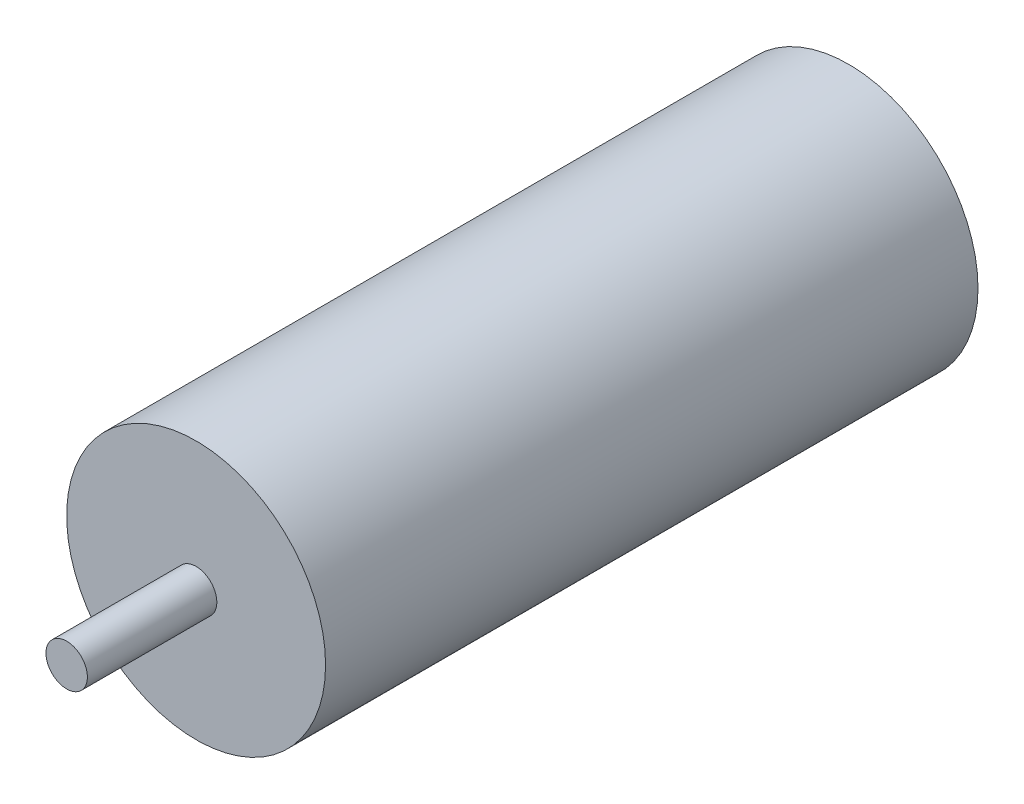
ISO-10303-21;
HEADER;
FILE_DESCRIPTION(('STEP AP214'),'2;1');
FILE_NAME('part.step','',(''),(''),'','','');
FILE_SCHEMA(('AUTOMOTIVE_DESIGN { 1 0 10303 214 1 1 1 1 }'));
ENDSEC;
DATA;
#1=APPLICATION_CONTEXT('core data for automotive mechanical design processes');
#2=APPLICATION_PROTOCOL_DEFINITION('international standard','automotive_design',2000,#1);
#3=PRODUCT_CONTEXT('',#1,'mechanical');
#4=PRODUCT('Part','Part','',(#3));
#5=PRODUCT_RELATED_PRODUCT_CATEGORY('part','',(#4));
#6=PRODUCT_DEFINITION_FORMATION('','',#4);
#7=PRODUCT_DEFINITION_CONTEXT('part definition',#1,'design');
#8=PRODUCT_DEFINITION('design','',#6,#7);
#9=PRODUCT_DEFINITION_SHAPE('','',#8);
#10=(LENGTH_UNIT() NAMED_UNIT(*) SI_UNIT(.MILLI.,.METRE.));
#11=(NAMED_UNIT(*) PLANE_ANGLE_UNIT() SI_UNIT($,.RADIAN.));
#12=(NAMED_UNIT(*) SI_UNIT($,.STERADIAN.) SOLID_ANGLE_UNIT());
#13=UNCERTAINTY_MEASURE_WITH_UNIT(LENGTH_MEASURE(1.E-05),#10,'distance_accuracy_value','');
#14=(GEOMETRIC_REPRESENTATION_CONTEXT(3) GLOBAL_UNCERTAINTY_ASSIGNED_CONTEXT((#13)) GLOBAL_UNIT_ASSIGNED_CONTEXT((#10,
#11,#12)) REPRESENTATION_CONTEXT('',''));
#15=CARTESIAN_POINT('',(0.,0.,0.));
#16=DIRECTION('',(0.,0.,1.));
#17=DIRECTION('',(1.,0.,0.));
#18=AXIS2_PLACEMENT_3D('',#15,#16,#17);
#19=CARTESIAN_POINT('',(0.,0.,63.));
#20=DIRECTION('',(0.,0.,-1.));
#21=DIRECTION('',(-1.,0.,0.));
#22=AXIS2_PLACEMENT_3D('',#19,#20,#21);
#23=CYLINDRICAL_SURFACE('',#22,12.5);
#24=CARTESIAN_POINT('',(0.,0.,63.));
#25=DIRECTION('',(0.,0.,1.));
#26=DIRECTION('',(1.,0.,0.));
#27=AXIS2_PLACEMENT_3D('',#24,#25,#26);
#28=CIRCLE('',#27,12.5);
#29=CARTESIAN_POINT('',(12.5,0.,63.));
#30=VERTEX_POINT('',#29);
#31=EDGE_CURVE('E38',#30,#30,#28,.T.);
#32=ORIENTED_EDGE('',*,*,#31,.F.);
#33=EDGE_LOOP('',(#32));
#34=FACE_BOUND('',#33,.T.);
#35=CARTESIAN_POINT('',(0.,0.,0.));
#36=DIRECTION('',(0.,0.,1.));
#37=DIRECTION('',(1.,0.,0.));
#38=AXIS2_PLACEMENT_3D('',#35,#36,#37);
#39=CIRCLE('',#38,12.5);
#40=CARTESIAN_POINT('',(12.5,0.,0.));
#41=VERTEX_POINT('',#40);
#42=EDGE_CURVE('E34',#41,#41,#39,.T.);
#43=ORIENTED_EDGE('',*,*,#42,.T.);
#44=EDGE_LOOP('',(#43));
#45=FACE_BOUND('',#44,.T.);
#46=ADVANCED_FACE('F31',(#34,#45),#23,.T.);
#47=CARTESIAN_POINT('',(0.,0.,63.));
#48=DIRECTION('',(0.,0.,1.));
#49=DIRECTION('',(1.,0.,0.));
#50=AXIS2_PLACEMENT_3D('',#47,#48,#49);
#51=PLANE('',#50);
#52=CARTESIAN_POINT('',(0.,0.,63.));
#53=DIRECTION('',(0.,0.,1.));
#54=DIRECTION('',(1.,0.,0.));
#55=AXIS2_PLACEMENT_3D('',#52,#53,#54);
#56=CIRCLE('',#55,2.);
#57=CARTESIAN_POINT('',(2.,0.,63.));
#58=VERTEX_POINT('',#57);
#59=EDGE_CURVE('E10',#58,#58,#56,.T.);
#60=ORIENTED_EDGE('',*,*,#59,.F.);
#61=EDGE_LOOP('',(#60));
#62=FACE_BOUND('',#61,.T.);
#63=ORIENTED_EDGE('',*,*,#31,.T.);
#64=EDGE_LOOP('',(#63));
#65=FACE_BOUND('',#64,.T.);
#66=ADVANCED_FACE('F55',(#62,#65),#51,.T.);
#67=CARTESIAN_POINT('',(0.,0.,0.));
#68=DIRECTION('',(0.,0.,1.));
#69=DIRECTION('',(1.,0.,0.));
#70=AXIS2_PLACEMENT_3D('',#67,#68,#69);
#71=PLANE('',#70);
#72=ORIENTED_EDGE('',*,*,#42,.F.);
#73=EDGE_LOOP('',(#72));
#74=FACE_BOUND('',#73,.T.);
#75=ADVANCED_FACE('F52',(#74),#71,.F.);
#76=CARTESIAN_POINT('',(0.,0.,75.5));
#77=DIRECTION('',(0.,0.,-1.));
#78=DIRECTION('',(-1.,0.,0.));
#79=AXIS2_PLACEMENT_3D('',#76,#77,#78);
#80=CYLINDRICAL_SURFACE('',#79,2.);
#81=CARTESIAN_POINT('',(0.,0.,75.5));
#82=DIRECTION('',(0.,0.,1.));
#83=DIRECTION('',(1.,0.,0.));
#84=AXIS2_PLACEMENT_3D('',#81,#82,#83);
#85=CIRCLE('',#84,2.);
#86=CARTESIAN_POINT('',(2.,0.,75.5));
#87=VERTEX_POINT('',#86);
#88=EDGE_CURVE('E44',#87,#87,#85,.T.);
#89=ORIENTED_EDGE('',*,*,#88,.F.);
#90=EDGE_LOOP('',(#89));
#91=FACE_BOUND('',#90,.T.);
#92=ORIENTED_EDGE('',*,*,#59,.T.);
#93=EDGE_LOOP('',(#92));
#94=FACE_BOUND('',#93,.T.);
#95=ADVANCED_FACE('F54',(#91,#94),#80,.T.);
#96=CARTESIAN_POINT('',(0.,0.,75.5));
#97=DIRECTION('',(0.,0.,1.));
#98=DIRECTION('',(1.,0.,0.));
#99=AXIS2_PLACEMENT_3D('',#96,#97,#98);
#100=PLANE('',#99);
#101=ORIENTED_EDGE('',*,*,#88,.T.);
#102=EDGE_LOOP('',(#101));
#103=FACE_BOUND('',#102,.T.);
#104=ADVANCED_FACE('F60',(#103),#100,.T.);
#105=CLOSED_SHELL('',(#46,#66,#75,#95,#104));
#106=MANIFOLD_SOLID_BREP('B2',#105);
#107=ADVANCED_BREP_SHAPE_REPRESENTATION('',(#18,#106),#14);
#108=SHAPE_DEFINITION_REPRESENTATION(#9,#107);
ENDSEC;
END-ISO-10303-21;
